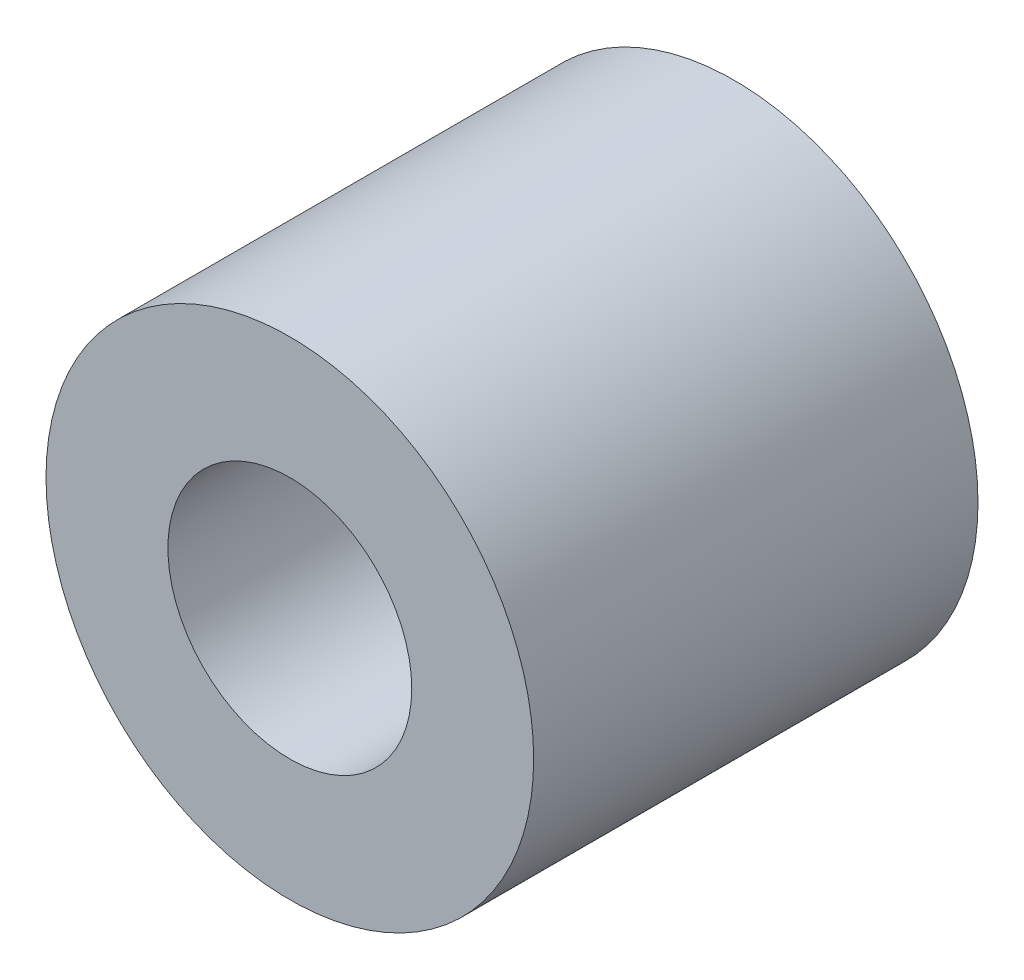
ISO-10303-21;
HEADER;
FILE_DESCRIPTION(('STEP AP214'),'2;1');
FILE_NAME('part.step','',(''),(''),'','','');
FILE_SCHEMA(('AUTOMOTIVE_DESIGN { 1 0 10303 214 1 1 1 1 }'));
ENDSEC;
DATA;
#1=APPLICATION_CONTEXT('core data for automotive mechanical design processes');
#2=APPLICATION_PROTOCOL_DEFINITION('international standard','automotive_design',2000,#1);
#3=PRODUCT_CONTEXT('',#1,'mechanical');
#4=PRODUCT('Part','Part','',(#3));
#5=PRODUCT_RELATED_PRODUCT_CATEGORY('part','',(#4));
#6=PRODUCT_DEFINITION_FORMATION('','',#4);
#7=PRODUCT_DEFINITION_CONTEXT('part definition',#1,'design');
#8=PRODUCT_DEFINITION('design','',#6,#7);
#9=PRODUCT_DEFINITION_SHAPE('','',#8);
#10=(LENGTH_UNIT() NAMED_UNIT(*) SI_UNIT(.MILLI.,.METRE.));
#11=(NAMED_UNIT(*) PLANE_ANGLE_UNIT() SI_UNIT($,.RADIAN.));
#12=(NAMED_UNIT(*) SI_UNIT($,.STERADIAN.) SOLID_ANGLE_UNIT());
#13=UNCERTAINTY_MEASURE_WITH_UNIT(LENGTH_MEASURE(1.E-05),#10,'distance_accuracy_value','');
#14=(GEOMETRIC_REPRESENTATION_CONTEXT(3) GLOBAL_UNCERTAINTY_ASSIGNED_CONTEXT((#13)) GLOBAL_UNIT_ASSIGNED_CONTEXT((#10,
#11,#12)) REPRESENTATION_CONTEXT('',''));
#15=CARTESIAN_POINT('',(0.,0.,0.));
#16=DIRECTION('',(0.,0.,1.));
#17=DIRECTION('',(1.,0.,0.));
#18=AXIS2_PLACEMENT_3D('',#15,#16,#17);
#19=CARTESIAN_POINT('',(0.,0.,8.2));
#20=DIRECTION('',(0.,0.,1.));
#21=DIRECTION('',(1.,0.,0.));
#22=AXIS2_PLACEMENT_3D('',#19,#20,#21);
#23=PLANE('',#22);
#24=CARTESIAN_POINT('',(0.,0.,8.2));
#25=DIRECTION('',(0.,0.,1.));
#26=DIRECTION('',(1.,0.,0.));
#27=AXIS2_PLACEMENT_3D('',#24,#25,#26);
#28=CIRCLE('',#27,4.5);
#29=CARTESIAN_POINT('',(4.5,0.,8.2));
#30=VERTEX_POINT('',#29);
#31=EDGE_CURVE('E10',#30,#30,#28,.T.);
#32=ORIENTED_EDGE('',*,*,#31,.T.);
#33=EDGE_LOOP('',(#32));
#34=FACE_BOUND('',#33,.T.);
#35=CARTESIAN_POINT('',(0.,0.,8.2));
#36=DIRECTION('',(0.,0.,1.));
#37=DIRECTION('',(1.,0.,0.));
#38=AXIS2_PLACEMENT_3D('',#35,#36,#37);
#39=CIRCLE('',#38,2.25);
#40=CARTESIAN_POINT('',(2.25,0.,8.2));
#41=VERTEX_POINT('',#40);
#42=EDGE_CURVE('E44',#41,#41,#39,.T.);
#43=ORIENTED_EDGE('',*,*,#42,.F.);
#44=EDGE_LOOP('',(#43));
#45=FACE_BOUND('',#44,.T.);
#46=ADVANCED_FACE('F33',(#34,#45),#23,.T.);
#47=CARTESIAN_POINT('',(0.,0.,0.));
#48=DIRECTION('',(0.,0.,1.));
#49=DIRECTION('',(1.,0.,0.));
#50=AXIS2_PLACEMENT_3D('',#47,#48,#49);
#51=PLANE('',#50);
#52=CARTESIAN_POINT('',(0.,0.,0.));
#53=DIRECTION('',(0.,0.,1.));
#54=DIRECTION('',(1.,0.,0.));
#55=AXIS2_PLACEMENT_3D('',#52,#53,#54);
#56=CIRCLE('',#55,4.5);
#57=CARTESIAN_POINT('',(4.5,0.,0.));
#58=VERTEX_POINT('',#57);
#59=EDGE_CURVE('E37',#58,#58,#56,.T.);
#60=ORIENTED_EDGE('',*,*,#59,.F.);
#61=EDGE_LOOP('',(#60));
#62=FACE_BOUND('',#61,.T.);
#63=CARTESIAN_POINT('',(0.,0.,0.));
#64=DIRECTION('',(0.,0.,1.));
#65=DIRECTION('',(1.,0.,0.));
#66=AXIS2_PLACEMENT_3D('',#63,#64,#65);
#67=CIRCLE('',#66,2.25);
#68=CARTESIAN_POINT('',(2.25,0.,0.));
#69=VERTEX_POINT('',#68);
#70=EDGE_CURVE('E46',#69,#69,#67,.T.);
#71=ORIENTED_EDGE('',*,*,#70,.T.);
#72=EDGE_LOOP('',(#71));
#73=FACE_BOUND('',#72,.T.);
#74=ADVANCED_FACE('F56',(#62,#73),#51,.F.);
#75=CARTESIAN_POINT('',(0.,0.,8.2));
#76=DIRECTION('',(0.,0.,-1.));
#77=DIRECTION('',(-1.,0.,0.));
#78=AXIS2_PLACEMENT_3D('',#75,#76,#77);
#79=CYLINDRICAL_SURFACE('',#78,4.5);
#80=ORIENTED_EDGE('',*,*,#31,.F.);
#81=EDGE_LOOP('',(#80));
#82=FACE_BOUND('',#81,.T.);
#83=ORIENTED_EDGE('',*,*,#59,.T.);
#84=EDGE_LOOP('',(#83));
#85=FACE_BOUND('',#84,.T.);
#86=ADVANCED_FACE('F35',(#82,#85),#79,.T.);
#87=CARTESIAN_POINT('',(0.,0.,8.2));
#88=DIRECTION('',(0.,0.,-1.));
#89=DIRECTION('',(-1.,0.,0.));
#90=AXIS2_PLACEMENT_3D('',#87,#88,#89);
#91=CYLINDRICAL_SURFACE('',#90,2.25);
#92=ORIENTED_EDGE('',*,*,#42,.T.);
#93=EDGE_LOOP('',(#92));
#94=FACE_BOUND('',#93,.T.);
#95=ORIENTED_EDGE('',*,*,#70,.F.);
#96=EDGE_LOOP('',(#95));
#97=FACE_BOUND('',#96,.T.);
#98=ADVANCED_FACE('F52',(#94,#97),#91,.F.);
#99=CLOSED_SHELL('',(#46,#74,#86,#98));
#100=MANIFOLD_SOLID_BREP('B2',#99);
#101=ADVANCED_BREP_SHAPE_REPRESENTATION('',(#18,#100),#14);
#102=SHAPE_DEFINITION_REPRESENTATION(#9,#101);
ENDSEC;
END-ISO-10303-21;
